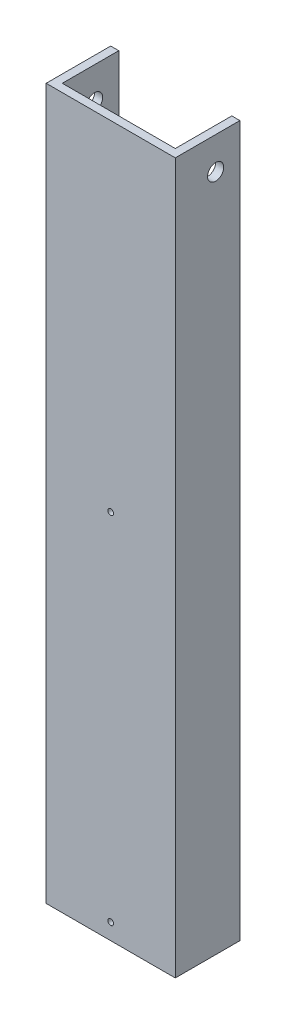
ISO-10303-21;
HEADER;
FILE_DESCRIPTION(('STEP AP214'),'2;1');
FILE_NAME('part.step','',(''),(''),'','','');
FILE_SCHEMA(('AUTOMOTIVE_DESIGN { 1 0 10303 214 1 1 1 1 }'));
ENDSEC;
DATA;
#1=APPLICATION_CONTEXT('core data for automotive mechanical design processes');
#2=APPLICATION_PROTOCOL_DEFINITION('international standard','automotive_design',2000,#1);
#3=PRODUCT_CONTEXT('',#1,'mechanical');
#4=PRODUCT('Part','Part','',(#3));
#5=PRODUCT_RELATED_PRODUCT_CATEGORY('part','',(#4));
#6=PRODUCT_DEFINITION_FORMATION('','',#4);
#7=PRODUCT_DEFINITION_CONTEXT('part definition',#1,'design');
#8=PRODUCT_DEFINITION('design','',#6,#7);
#9=PRODUCT_DEFINITION_SHAPE('','',#8);
#10=(LENGTH_UNIT() NAMED_UNIT(*) SI_UNIT(.MILLI.,.METRE.));
#11=(NAMED_UNIT(*) PLANE_ANGLE_UNIT() SI_UNIT($,.RADIAN.));
#12=(NAMED_UNIT(*) SI_UNIT($,.STERADIAN.) SOLID_ANGLE_UNIT());
#13=UNCERTAINTY_MEASURE_WITH_UNIT(LENGTH_MEASURE(1.E-05),#10,'distance_accuracy_value','');
#14=(GEOMETRIC_REPRESENTATION_CONTEXT(3) GLOBAL_UNCERTAINTY_ASSIGNED_CONTEXT((#13)) GLOBAL_UNIT_ASSIGNED_CONTEXT((#10,
#11,#12)) REPRESENTATION_CONTEXT('',''));
#15=CARTESIAN_POINT('',(0.,0.,0.));
#16=DIRECTION('',(0.,0.,1.));
#17=DIRECTION('',(1.,0.,0.));
#18=AXIS2_PLACEMENT_3D('',#15,#16,#17);
#19=CARTESIAN_POINT('',(-22.225,279.4,-25.4));
#20=DIRECTION('',(0.,0.,1.));
#21=DIRECTION('',(1.,0.,0.));
#22=AXIS2_PLACEMENT_3D('',#19,#20,#21);
#23=PLANE('',#22);
#24=DIRECTION('',(-1.,0.,0.));
#25=VECTOR('',#24,1.);
#26=CARTESIAN_POINT('',(-22.225,0.,-25.4));
#27=LINE('',#26,#25);
#28=CARTESIAN_POINT('',(-22.225,0.,-25.4));
#29=VERTEX_POINT('',#28);
#30=CARTESIAN_POINT('',(-25.4,0.,-25.4));
#31=VERTEX_POINT('',#30);
#32=EDGE_CURVE('E133',#29,#31,#27,.T.);
#33=ORIENTED_EDGE('',*,*,#32,.T.);
#34=DIRECTION('',(0.,-1.,0.));
#35=VECTOR('',#34,1.);
#36=CARTESIAN_POINT('',(-25.4,279.4,-25.4));
#37=LINE('',#36,#35);
#38=CARTESIAN_POINT('',(-25.4,279.4,-25.4));
#39=VERTEX_POINT('',#38);
#40=EDGE_CURVE('E11',#39,#31,#37,.T.);
#41=ORIENTED_EDGE('',*,*,#40,.F.);
#42=DIRECTION('',(-1.,0.,0.));
#43=VECTOR('',#42,1.);
#44=CARTESIAN_POINT('',(-22.225,279.4,-25.4));
#45=LINE('',#44,#43);
#46=CARTESIAN_POINT('',(-22.225,279.4,-25.4));
#47=VERTEX_POINT('',#46);
#48=EDGE_CURVE('E148',#47,#39,#45,.T.);
#49=ORIENTED_EDGE('',*,*,#48,.F.);
#50=DIRECTION('',(0.,-1.,0.));
#51=VECTOR('',#50,1.);
#52=CARTESIAN_POINT('',(-22.225,279.4,-25.4));
#53=LINE('',#52,#51);
#54=EDGE_CURVE('E129',#47,#29,#53,.T.);
#55=ORIENTED_EDGE('',*,*,#54,.T.);
#56=EDGE_LOOP('',(#33,#41,#49,#55));
#57=FACE_BOUND('',#56,.T.);
#58=ADVANCED_FACE('F36',(#57),#23,.F.);
#59=CARTESIAN_POINT('',(-25.4,279.4,-25.4));
#60=DIRECTION('',(1.,0.,0.));
#61=DIRECTION('',(0.,0.,-1.));
#62=AXIS2_PLACEMENT_3D('',#59,#60,#61);
#63=PLANE('',#62);
#64=CARTESIAN_POINT('',(-25.4,266.7,-15.875));
#65=DIRECTION('',(1.,0.,0.));
#66=DIRECTION('',(0.,0.,-1.));
#67=AXIS2_PLACEMENT_3D('',#64,#65,#66);
#68=CIRCLE('',#67,3.175);
#69=CARTESIAN_POINT('',(-25.4,266.7,-19.05));
#70=VERTEX_POINT('',#69);
#71=EDGE_CURVE('E187',#70,#70,#68,.T.);
#72=ORIENTED_EDGE('',*,*,#71,.T.);
#73=EDGE_LOOP('',(#72));
#74=FACE_BOUND('',#73,.T.);
#75=DIRECTION('',(0.,0.,1.));
#76=VECTOR('',#75,1.);
#77=CARTESIAN_POINT('',(-25.4,0.,-25.4));
#78=LINE('',#77,#76);
#79=CARTESIAN_POINT('',(-25.4,0.,0.));
#80=VERTEX_POINT('',#79);
#81=EDGE_CURVE('E136',#31,#80,#78,.T.);
#82=ORIENTED_EDGE('',*,*,#81,.T.);
#83=DIRECTION('',(0.,-1.,0.));
#84=VECTOR('',#83,1.);
#85=CARTESIAN_POINT('',(-25.4,279.4,0.));
#86=LINE('',#85,#84);
#87=CARTESIAN_POINT('',(-25.4,279.4,0.));
#88=VERTEX_POINT('',#87);
#89=EDGE_CURVE('E45',#88,#80,#86,.T.);
#90=ORIENTED_EDGE('',*,*,#89,.F.);
#91=DIRECTION('',(0.,0.,1.));
#92=VECTOR('',#91,1.);
#93=CARTESIAN_POINT('',(-25.4,279.4,-25.4));
#94=LINE('',#93,#92);
#95=EDGE_CURVE('E96',#39,#88,#94,.T.);
#96=ORIENTED_EDGE('',*,*,#95,.F.);
#97=ORIENTED_EDGE('',*,*,#40,.T.);
#98=EDGE_LOOP('',(#82,#90,#96,#97));
#99=FACE_BOUND('',#98,.T.);
#100=ADVANCED_FACE('F207',(#74,#99),#63,.F.);
#101=CARTESIAN_POINT('',(-25.4,279.4,0.));
#102=DIRECTION('',(0.,0.,-1.));
#103=DIRECTION('',(-1.,0.,0.));
#104=AXIS2_PLACEMENT_3D('',#101,#102,#103);
#105=PLANE('',#104);
#106=CARTESIAN_POINT('',(0.,146.05,0.));
#107=DIRECTION('',(0.,0.,1.));
#108=DIRECTION('',(1.,0.,0.));
#109=AXIS2_PLACEMENT_3D('',#106,#107,#108);
#110=CIRCLE('',#109,1.1303);
#111=CARTESIAN_POINT('',(1.1303,146.05,0.));
#112=VERTEX_POINT('',#111);
#113=EDGE_CURVE('E199',#112,#112,#110,.T.);
#114=ORIENTED_EDGE('',*,*,#113,.F.);
#115=EDGE_LOOP('',(#114));
#116=FACE_BOUND('',#115,.T.);
#117=CARTESIAN_POINT('',(0.,6.35000000000001,0.));
#118=DIRECTION('',(0.,0.,1.));
#119=DIRECTION('',(1.,0.,0.));
#120=AXIS2_PLACEMENT_3D('',#117,#118,#119);
#121=CIRCLE('',#120,1.1303);
#122=CARTESIAN_POINT('',(1.1303,6.35000000000001,0.));
#123=VERTEX_POINT('',#122);
#124=EDGE_CURVE('E193',#123,#123,#121,.T.);
#125=ORIENTED_EDGE('',*,*,#124,.F.);
#126=EDGE_LOOP('',(#125));
#127=FACE_BOUND('',#126,.T.);
#128=DIRECTION('',(1.,0.,0.));
#129=VECTOR('',#128,1.);
#130=CARTESIAN_POINT('',(-25.4,0.,0.));
#131=LINE('',#130,#129);
#132=CARTESIAN_POINT('',(25.4,0.,0.));
#133=VERTEX_POINT('',#132);
#134=EDGE_CURVE('E139',#80,#133,#131,.T.);
#135=ORIENTED_EDGE('',*,*,#134,.T.);
#136=DIRECTION('',(0.,-1.,0.));
#137=VECTOR('',#136,1.);
#138=CARTESIAN_POINT('',(25.4,279.4,0.));
#139=LINE('',#138,#137);
#140=CARTESIAN_POINT('',(25.4,279.4,0.));
#141=VERTEX_POINT('',#140);
#142=EDGE_CURVE('E155',#141,#133,#139,.T.);
#143=ORIENTED_EDGE('',*,*,#142,.F.);
#144=DIRECTION('',(1.,0.,0.));
#145=VECTOR('',#144,1.);
#146=CARTESIAN_POINT('',(-25.4,279.4,0.));
#147=LINE('',#146,#145);
#148=EDGE_CURVE('E164',#88,#141,#147,.T.);
#149=ORIENTED_EDGE('',*,*,#148,.F.);
#150=ORIENTED_EDGE('',*,*,#89,.T.);
#151=EDGE_LOOP('',(#135,#143,#149,#150));
#152=FACE_BOUND('',#151,.T.);
#153=ADVANCED_FACE('F162',(#116,#127,#152),#105,.F.);
#154=CARTESIAN_POINT('',(25.4,279.4,0.));
#155=DIRECTION('',(-1.,0.,0.));
#156=DIRECTION('',(0.,0.,1.));
#157=AXIS2_PLACEMENT_3D('',#154,#155,#156);
#158=PLANE('',#157);
#159=CARTESIAN_POINT('',(25.4,266.7,-15.875));
#160=DIRECTION('',(1.,0.,0.));
#161=DIRECTION('',(0.,0.,-1.));
#162=AXIS2_PLACEMENT_3D('',#159,#160,#161);
#163=CIRCLE('',#162,3.175);
#164=CARTESIAN_POINT('',(25.4,266.7,-19.05));
#165=VERTEX_POINT('',#164);
#166=EDGE_CURVE('E184',#165,#165,#163,.T.);
#167=ORIENTED_EDGE('',*,*,#166,.F.);
#168=EDGE_LOOP('',(#167));
#169=FACE_BOUND('',#168,.T.);
#170=DIRECTION('',(0.,0.,-1.));
#171=VECTOR('',#170,1.);
#172=CARTESIAN_POINT('',(25.4,0.,0.));
#173=LINE('',#172,#171);
#174=CARTESIAN_POINT('',(25.4,0.,-25.4));
#175=VERTEX_POINT('',#174);
#176=EDGE_CURVE('E141',#133,#175,#173,.T.);
#177=ORIENTED_EDGE('',*,*,#176,.T.);
#178=DIRECTION('',(0.,-1.,0.));
#179=VECTOR('',#178,1.);
#180=CARTESIAN_POINT('',(25.4,279.4,-25.4));
#181=LINE('',#180,#179);
#182=CARTESIAN_POINT('',(25.4,279.4,-25.4));
#183=VERTEX_POINT('',#182);
#184=EDGE_CURVE('E152',#183,#175,#181,.T.);
#185=ORIENTED_EDGE('',*,*,#184,.F.);
#186=DIRECTION('',(0.,0.,-1.));
#187=VECTOR('',#186,1.);
#188=CARTESIAN_POINT('',(25.4,279.4,0.));
#189=LINE('',#188,#187);
#190=EDGE_CURVE('E176',#141,#183,#189,.T.);
#191=ORIENTED_EDGE('',*,*,#190,.F.);
#192=ORIENTED_EDGE('',*,*,#142,.T.);
#193=EDGE_LOOP('',(#177,#185,#191,#192));
#194=FACE_BOUND('',#193,.T.);
#195=ADVANCED_FACE('F172',(#169,#194),#158,.F.);
#196=CARTESIAN_POINT('',(25.4,279.4,-25.4));
#197=DIRECTION('',(0.,0.,1.));
#198=DIRECTION('',(1.,0.,0.));
#199=AXIS2_PLACEMENT_3D('',#196,#197,#198);
#200=PLANE('',#199);
#201=DIRECTION('',(-1.,0.,0.));
#202=VECTOR('',#201,1.);
#203=CARTESIAN_POINT('',(25.4,0.,-25.4));
#204=LINE('',#203,#202);
#205=CARTESIAN_POINT('',(22.225,0.,-25.4));
#206=VERTEX_POINT('',#205);
#207=EDGE_CURVE('E143',#175,#206,#204,.T.);
#208=ORIENTED_EDGE('',*,*,#207,.T.);
#209=DIRECTION('',(0.,-1.,0.));
#210=VECTOR('',#209,1.);
#211=CARTESIAN_POINT('',(22.225,279.4,-25.4));
#212=LINE('',#211,#210);
#213=CARTESIAN_POINT('',(22.225,279.4,-25.4));
#214=VERTEX_POINT('',#213);
#215=EDGE_CURVE('E124',#214,#206,#212,.T.);
#216=ORIENTED_EDGE('',*,*,#215,.F.);
#217=DIRECTION('',(-1.,0.,0.));
#218=VECTOR('',#217,1.);
#219=CARTESIAN_POINT('',(25.4,279.4,-25.4));
#220=LINE('',#219,#218);
#221=EDGE_CURVE('E115',#183,#214,#220,.T.);
#222=ORIENTED_EDGE('',*,*,#221,.F.);
#223=ORIENTED_EDGE('',*,*,#184,.T.);
#224=EDGE_LOOP('',(#208,#216,#222,#223));
#225=FACE_BOUND('',#224,.T.);
#226=ADVANCED_FACE('F175',(#225),#200,.F.);
#227=CARTESIAN_POINT('',(22.225,279.4,-25.4));
#228=DIRECTION('',(1.,0.,0.));
#229=DIRECTION('',(0.,0.,-1.));
#230=AXIS2_PLACEMENT_3D('',#227,#228,#229);
#231=PLANE('',#230);
#232=CARTESIAN_POINT('',(22.225,266.7,-15.875));
#233=DIRECTION('',(1.,0.,0.));
#234=DIRECTION('',(0.,0.,-1.));
#235=AXIS2_PLACEMENT_3D('',#232,#233,#234);
#236=CIRCLE('',#235,3.175);
#237=CARTESIAN_POINT('',(22.225,266.7,-19.05));
#238=VERTEX_POINT('',#237);
#239=EDGE_CURVE('E137',#238,#238,#236,.T.);
#240=ORIENTED_EDGE('',*,*,#239,.T.);
#241=EDGE_LOOP('',(#240));
#242=FACE_BOUND('',#241,.T.);
#243=DIRECTION('',(0.,0.,1.));
#244=VECTOR('',#243,1.);
#245=CARTESIAN_POINT('',(22.225,0.,-25.4));
#246=LINE('',#245,#244);
#247=CARTESIAN_POINT('',(22.225,0.,-3.175));
#248=VERTEX_POINT('',#247);
#249=EDGE_CURVE('E123',#206,#248,#246,.T.);
#250=ORIENTED_EDGE('',*,*,#249,.T.);
#251=DIRECTION('',(0.,-1.,0.));
#252=VECTOR('',#251,1.);
#253=CARTESIAN_POINT('',(22.225,279.4,-3.175));
#254=LINE('',#253,#252);
#255=CARTESIAN_POINT('',(22.225,279.4,-3.175));
#256=VERTEX_POINT('',#255);
#257=EDGE_CURVE('E120',#256,#248,#254,.T.);
#258=ORIENTED_EDGE('',*,*,#257,.F.);
#259=DIRECTION('',(0.,0.,1.));
#260=VECTOR('',#259,1.);
#261=CARTESIAN_POINT('',(22.225,279.4,-25.4));
#262=LINE('',#261,#260);
#263=EDGE_CURVE('E109',#214,#256,#262,.T.);
#264=ORIENTED_EDGE('',*,*,#263,.F.);
#265=ORIENTED_EDGE('',*,*,#215,.T.);
#266=EDGE_LOOP('',(#250,#258,#264,#265));
#267=FACE_BOUND('',#266,.T.);
#268=ADVANCED_FACE('F121',(#242,#267),#231,.F.);
#269=CARTESIAN_POINT('',(22.225,279.4,-3.175));
#270=DIRECTION('',(0.,0.,1.));
#271=DIRECTION('',(1.,0.,0.));
#272=AXIS2_PLACEMENT_3D('',#269,#270,#271);
#273=PLANE('',#272);
#274=CARTESIAN_POINT('',(0.,146.05,-3.175));
#275=DIRECTION('',(0.,0.,1.));
#276=DIRECTION('',(1.,0.,0.));
#277=AXIS2_PLACEMENT_3D('',#274,#275,#276);
#278=CIRCLE('',#277,1.1303);
#279=CARTESIAN_POINT('',(1.1303,146.05,-3.175));
#280=VERTEX_POINT('',#279);
#281=EDGE_CURVE('E196',#280,#280,#278,.T.);
#282=ORIENTED_EDGE('',*,*,#281,.T.);
#283=EDGE_LOOP('',(#282));
#284=FACE_BOUND('',#283,.T.);
#285=CARTESIAN_POINT('',(0.,6.35000000000001,-3.175));
#286=DIRECTION('',(0.,0.,1.));
#287=DIRECTION('',(1.,0.,0.));
#288=AXIS2_PLACEMENT_3D('',#285,#286,#287);
#289=CIRCLE('',#288,1.1303);
#290=CARTESIAN_POINT('',(1.1303,6.35000000000001,-3.175));
#291=VERTEX_POINT('',#290);
#292=EDGE_CURVE('E188',#291,#291,#289,.T.);
#293=ORIENTED_EDGE('',*,*,#292,.T.);
#294=EDGE_LOOP('',(#293));
#295=FACE_BOUND('',#294,.T.);
#296=DIRECTION('',(-1.,0.,0.));
#297=VECTOR('',#296,1.);
#298=CARTESIAN_POINT('',(22.225,0.,-3.175));
#299=LINE('',#298,#297);
#300=CARTESIAN_POINT('',(-22.225,0.,-3.175));
#301=VERTEX_POINT('',#300);
#302=EDGE_CURVE('E82',#248,#301,#299,.T.);
#303=ORIENTED_EDGE('',*,*,#302,.T.);
#304=DIRECTION('',(0.,-1.,0.));
#305=VECTOR('',#304,1.);
#306=CARTESIAN_POINT('',(-22.225,279.4,-3.175));
#307=LINE('',#306,#305);
#308=CARTESIAN_POINT('',(-22.225,279.4,-3.175));
#309=VERTEX_POINT('',#308);
#310=EDGE_CURVE('E125',#309,#301,#307,.T.);
#311=ORIENTED_EDGE('',*,*,#310,.F.);
#312=DIRECTION('',(-1.,0.,0.));
#313=VECTOR('',#312,1.);
#314=CARTESIAN_POINT('',(22.225,279.4,-3.175));
#315=LINE('',#314,#313);
#316=EDGE_CURVE('E113',#256,#309,#315,.T.);
#317=ORIENTED_EDGE('',*,*,#316,.F.);
#318=ORIENTED_EDGE('',*,*,#257,.T.);
#319=EDGE_LOOP('',(#303,#311,#317,#318));
#320=FACE_BOUND('',#319,.T.);
#321=ADVANCED_FACE('F127',(#284,#295,#320),#273,.F.);
#322=CARTESIAN_POINT('',(-22.225,279.4,-3.175));
#323=DIRECTION('',(-1.,0.,0.));
#324=DIRECTION('',(0.,0.,1.));
#325=AXIS2_PLACEMENT_3D('',#322,#323,#324);
#326=PLANE('',#325);
#327=CARTESIAN_POINT('',(-22.225,266.7,-15.875));
#328=DIRECTION('',(-1.,0.,0.));
#329=DIRECTION('',(0.,0.,1.));
#330=AXIS2_PLACEMENT_3D('',#327,#328,#329);
#331=CIRCLE('',#330,3.175);
#332=CARTESIAN_POINT('',(-22.225,266.7,-12.7));
#333=VERTEX_POINT('',#332);
#334=EDGE_CURVE('E39',#333,#333,#331,.T.);
#335=ORIENTED_EDGE('',*,*,#334,.T.);
#336=EDGE_LOOP('',(#335));
#337=FACE_BOUND('',#336,.T.);
#338=DIRECTION('',(0.,0.,-1.));
#339=VECTOR('',#338,1.);
#340=CARTESIAN_POINT('',(-22.225,0.,-3.175));
#341=LINE('',#340,#339);
#342=EDGE_CURVE('E88',#301,#29,#341,.T.);
#343=ORIENTED_EDGE('',*,*,#342,.T.);
#344=ORIENTED_EDGE('',*,*,#54,.F.);
#345=DIRECTION('',(0.,0.,-1.));
#346=VECTOR('',#345,1.);
#347=CARTESIAN_POINT('',(-22.225,279.4,-3.175));
#348=LINE('',#347,#346);
#349=EDGE_CURVE('E53',#309,#47,#348,.T.);
#350=ORIENTED_EDGE('',*,*,#349,.F.);
#351=ORIENTED_EDGE('',*,*,#310,.T.);
#352=EDGE_LOOP('',(#343,#344,#350,#351));
#353=FACE_BOUND('',#352,.T.);
#354=ADVANCED_FACE('F234',(#337,#353),#326,.F.);
#355=CARTESIAN_POINT('',(0.,279.4,0.));
#356=DIRECTION('',(0.,1.,0.));
#357=DIRECTION('',(0.,0.,1.));
#358=AXIS2_PLACEMENT_3D('',#355,#356,#357);
#359=PLANE('',#358);
#360=ORIENTED_EDGE('',*,*,#48,.T.);
#361=ORIENTED_EDGE('',*,*,#95,.T.);
#362=ORIENTED_EDGE('',*,*,#148,.T.);
#363=ORIENTED_EDGE('',*,*,#190,.T.);
#364=ORIENTED_EDGE('',*,*,#221,.T.);
#365=ORIENTED_EDGE('',*,*,#263,.T.);
#366=ORIENTED_EDGE('',*,*,#316,.T.);
#367=ORIENTED_EDGE('',*,*,#349,.T.);
#368=EDGE_LOOP('',(#360,#361,#362,#363,#364,#365,#366,#367));
#369=FACE_BOUND('',#368,.T.);
#370=ADVANCED_FACE('F111',(#369),#359,.T.);
#371=CARTESIAN_POINT('',(0.,0.,0.));
#372=DIRECTION('',(0.,1.,0.));
#373=DIRECTION('',(0.,0.,1.));
#374=AXIS2_PLACEMENT_3D('',#371,#372,#373);
#375=PLANE('',#374);
#376=ORIENTED_EDGE('',*,*,#32,.F.);
#377=ORIENTED_EDGE('',*,*,#342,.F.);
#378=ORIENTED_EDGE('',*,*,#302,.F.);
#379=ORIENTED_EDGE('',*,*,#249,.F.);
#380=ORIENTED_EDGE('',*,*,#207,.F.);
#381=ORIENTED_EDGE('',*,*,#176,.F.);
#382=ORIENTED_EDGE('',*,*,#134,.F.);
#383=ORIENTED_EDGE('',*,*,#81,.F.);
#384=EDGE_LOOP('',(#376,#377,#378,#379,#380,#381,#382,#383));
#385=FACE_BOUND('',#384,.T.);
#386=ADVANCED_FACE('F168',(#385),#375,.F.);
#387=CARTESIAN_POINT('',(-25.4,266.7,-15.875));
#388=DIRECTION('',(1.,0.,0.));
#389=DIRECTION('',(0.,0.,-1.));
#390=AXIS2_PLACEMENT_3D('',#387,#388,#389);
#391=CYLINDRICAL_SURFACE('',#390,3.175);
#392=ORIENTED_EDGE('',*,*,#71,.F.);
#393=EDGE_LOOP('',(#392));
#394=FACE_BOUND('',#393,.T.);
#395=ORIENTED_EDGE('',*,*,#334,.F.);
#396=EDGE_LOOP('',(#395));
#397=FACE_BOUND('',#396,.T.);
#398=ADVANCED_FACE('F222',(#394,#397),#391,.F.);
#399=ORIENTED_EDGE('',*,*,#166,.T.);
#400=EDGE_LOOP('',(#399));
#401=FACE_BOUND('',#400,.T.);
#402=ORIENTED_EDGE('',*,*,#239,.F.);
#403=EDGE_LOOP('',(#402));
#404=FACE_BOUND('',#403,.T.);
#405=ADVANCED_FACE('F213',(#401,#404),#391,.F.);
#406=CARTESIAN_POINT('',(0.,6.35000000000001,0.));
#407=DIRECTION('',(0.,0.,1.));
#408=DIRECTION('',(1.,0.,0.));
#409=AXIS2_PLACEMENT_3D('',#406,#407,#408);
#410=CYLINDRICAL_SURFACE('',#409,1.1303);
#411=ORIENTED_EDGE('',*,*,#292,.F.);
#412=EDGE_LOOP('',(#411));
#413=FACE_BOUND('',#412,.T.);
#414=ORIENTED_EDGE('',*,*,#124,.T.);
#415=EDGE_LOOP('',(#414));
#416=FACE_BOUND('',#415,.T.);
#417=ADVANCED_FACE('F211',(#413,#416),#410,.F.);
#418=CARTESIAN_POINT('',(0.,146.05,0.));
#419=DIRECTION('',(0.,0.,1.));
#420=DIRECTION('',(1.,0.,0.));
#421=AXIS2_PLACEMENT_3D('',#418,#419,#420);
#422=CYLINDRICAL_SURFACE('',#421,1.1303);
#423=ORIENTED_EDGE('',*,*,#281,.F.);
#424=EDGE_LOOP('',(#423));
#425=FACE_BOUND('',#424,.T.);
#426=ORIENTED_EDGE('',*,*,#113,.T.);
#427=EDGE_LOOP('',(#426));
#428=FACE_BOUND('',#427,.T.);
#429=ADVANCED_FACE('F203',(#425,#428),#422,.F.);
#430=CLOSED_SHELL('',(#58,#100,#153,#195,#226,#268,#321,#354,#370,#386,#398,#405,#417,#429));
#431=MANIFOLD_SOLID_BREP('B2',#430);
#432=ADVANCED_BREP_SHAPE_REPRESENTATION('',(#18,#431),#14);
#433=SHAPE_DEFINITION_REPRESENTATION(#9,#432);
ENDSEC;
END-ISO-10303-21;
